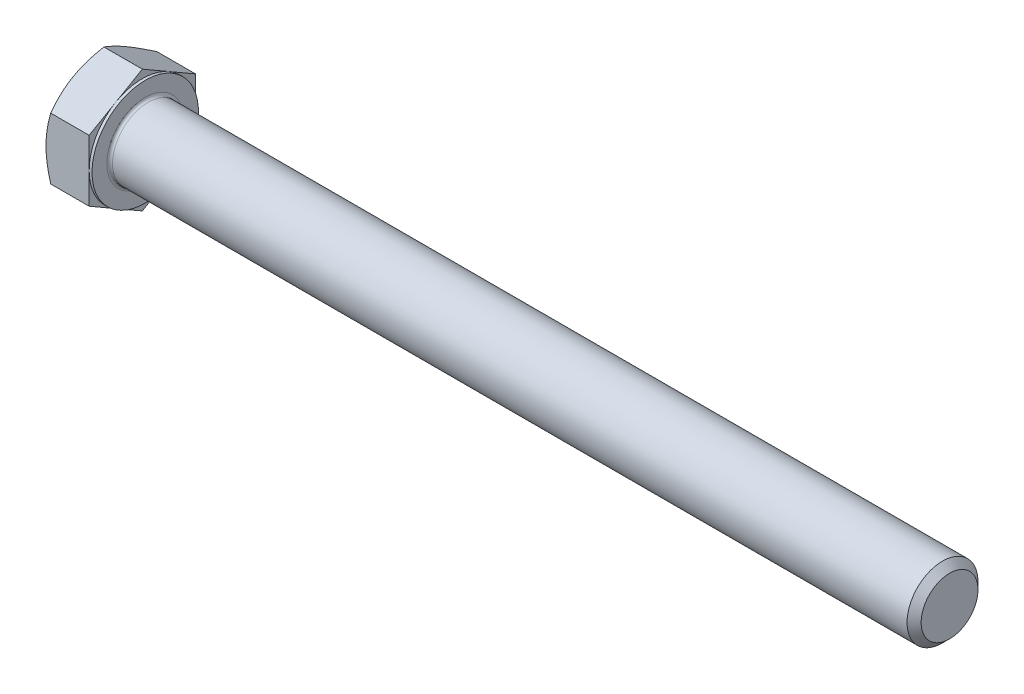
ISO-10303-21;
HEADER;
FILE_DESCRIPTION(('STEP AP214'),'2;1');
FILE_NAME('part.step','',(''),(''),'','','');
FILE_SCHEMA(('AUTOMOTIVE_DESIGN { 1 0 10303 214 1 1 1 1 }'));
ENDSEC;
DATA;
#1=APPLICATION_CONTEXT('core data for automotive mechanical design processes');
#2=APPLICATION_PROTOCOL_DEFINITION('international standard','automotive_design',2000,#1);
#3=PRODUCT_CONTEXT('',#1,'mechanical');
#4=PRODUCT('Part','Part','',(#3));
#5=PRODUCT_RELATED_PRODUCT_CATEGORY('part','',(#4));
#6=PRODUCT_DEFINITION_FORMATION('','',#4);
#7=PRODUCT_DEFINITION_CONTEXT('part definition',#1,'design');
#8=PRODUCT_DEFINITION('design','',#6,#7);
#9=PRODUCT_DEFINITION_SHAPE('','',#8);
#10=(LENGTH_UNIT() NAMED_UNIT(*) SI_UNIT(.MILLI.,.METRE.));
#11=(NAMED_UNIT(*) PLANE_ANGLE_UNIT() SI_UNIT($,.RADIAN.));
#12=(NAMED_UNIT(*) SI_UNIT($,.STERADIAN.) SOLID_ANGLE_UNIT());
#13=UNCERTAINTY_MEASURE_WITH_UNIT(LENGTH_MEASURE(1.E-05),#10,'distance_accuracy_value','');
#14=(GEOMETRIC_REPRESENTATION_CONTEXT(3) GLOBAL_UNCERTAINTY_ASSIGNED_CONTEXT((#13)) GLOBAL_UNIT_ASSIGNED_CONTEXT((#10,
#11,#12)) REPRESENTATION_CONTEXT('',''));
#15=CARTESIAN_POINT('',(0.,0.,0.));
#16=DIRECTION('',(0.,0.,1.));
#17=DIRECTION('',(1.,0.,0.));
#18=AXIS2_PLACEMENT_3D('',#15,#16,#17);
#19=CARTESIAN_POINT('',(0.,8.24155962262808,0.));
#20=DIRECTION('',(1.,0.,0.));
#21=DIRECTION('',(0.,0.,-1.));
#22=AXIS2_PLACEMENT_3D('',#19,#20,#21);
#23=PLANE('',#22);
#24=CARTESIAN_POINT('',(0.,0.,0.));
#25=DIRECTION('',(1.,0.,0.));
#26=DIRECTION('',(0.,0.,-1.));
#27=AXIS2_PLACEMENT_3D('',#24,#25,#26);
#28=CIRCLE('',#27,7.1374);
#29=CARTESIAN_POINT('',(0.,-6.18116971697105,-3.56870000000001));
#30=VERTEX_POINT('',#29);
#31=CARTESIAN_POINT('',(0.,0.,-7.1374));
#32=VERTEX_POINT('',#31);
#33=EDGE_CURVE('E115',#30,#32,#28,.T.);
#34=ORIENTED_EDGE('',*,*,#33,.F.);
#35=CARTESIAN_POINT('',(0.,0.,0.));
#36=DIRECTION('',(1.,0.,0.));
#37=DIRECTION('',(0.,0.,-1.));
#38=AXIS2_PLACEMENT_3D('',#35,#36,#37);
#39=CIRCLE('',#38,7.1374);
#40=CARTESIAN_POINT('',(0.,-6.18116971697106,3.56870000000001));
#41=VERTEX_POINT('',#40);
#42=EDGE_CURVE('E112',#41,#30,#39,.T.);
#43=ORIENTED_EDGE('',*,*,#42,.F.);
#44=CARTESIAN_POINT('',(0.,0.,0.));
#45=DIRECTION('',(1.,0.,0.));
#46=DIRECTION('',(0.,0.,-1.));
#47=AXIS2_PLACEMENT_3D('',#44,#45,#46);
#48=CIRCLE('',#47,7.1374);
#49=CARTESIAN_POINT('',(0.,0.,7.1374));
#50=VERTEX_POINT('',#49);
#51=EDGE_CURVE('E463',#50,#41,#48,.T.);
#52=ORIENTED_EDGE('',*,*,#51,.F.);
#53=CARTESIAN_POINT('',(0.,0.,0.));
#54=DIRECTION('',(1.,0.,0.));
#55=DIRECTION('',(0.,0.,-1.));
#56=AXIS2_PLACEMENT_3D('',#53,#54,#55);
#57=CIRCLE('',#56,7.1374);
#58=CARTESIAN_POINT('',(0.,6.18116971697105,3.56870000000001));
#59=VERTEX_POINT('',#58);
#60=EDGE_CURVE('E173',#59,#50,#57,.T.);
#61=ORIENTED_EDGE('',*,*,#60,.F.);
#62=CARTESIAN_POINT('',(0.,0.,0.));
#63=DIRECTION('',(1.,0.,0.));
#64=DIRECTION('',(0.,0.,-1.));
#65=AXIS2_PLACEMENT_3D('',#62,#63,#64);
#66=CIRCLE('',#65,7.1374);
#67=CARTESIAN_POINT('',(0.,6.18116971697105,-3.56870000000001));
#68=VERTEX_POINT('',#67);
#69=EDGE_CURVE('E461',#68,#59,#66,.T.);
#70=ORIENTED_EDGE('',*,*,#69,.F.);
#71=CARTESIAN_POINT('',(0.,0.,0.));
#72=DIRECTION('',(1.,0.,0.));
#73=DIRECTION('',(0.,0.,-1.));
#74=AXIS2_PLACEMENT_3D('',#71,#72,#73);
#75=CIRCLE('',#74,7.1374);
#76=EDGE_CURVE('E118',#32,#68,#75,.T.);
#77=ORIENTED_EDGE('',*,*,#76,.F.);
#78=EDGE_LOOP('',(#34,#43,#52,#61,#70,#77));
#79=FACE_BOUND('',#78,.T.);
#80=ADVANCED_FACE('F18',(#79),#23,.F.);
#81=CARTESIAN_POINT('',(0.641311776484754,0.,0.));
#82=DIRECTION('',(1.,0.,0.));
#83=DIRECTION('',(0.,0.,-1.));
#84=AXIS2_PLACEMENT_3D('',#81,#82,#83);
#85=CONICAL_SURFACE('',#84,8.24818458036387,1.0471975511966);
#86=ORIENTED_EDGE('',*,*,#42,.T.);
#87=CARTESIAN_POINT('',(0.,-6.18116971697106,-3.56870000000002));
#88=CARTESIAN_POINT('',(-2.91702878281906E-05,-6.26862170985652,-3.41722870509925));
#89=CARTESIAN_POINT('',(0.00371114889844038,-6.35606948988297,-3.26576470708432));
#90=CARTESIAN_POINT('',(0.0185139577467835,-6.53079334497843,-2.9631341127647));
#91=CARTESIAN_POINT('',(0.0295749978503088,-6.61806945060963,-2.81196746352471));
#92=CARTESIAN_POINT('',(0.0587296036169501,-6.7918862225359,-2.5109079833408));
#93=CARTESIAN_POINT('',(0.0767877659737066,-6.87842838481195,-2.3610125612818));
#94=CARTESIAN_POINT('',(0.119548178265526,-7.05110039256495,-2.06193587080869));
#95=CARTESIAN_POINT('',(0.144250603082628,-7.13723022712836,-1.91275462129736));
#96=CARTESIAN_POINT('',(0.227561148311189,-7.39464422393007,-1.46690050025742));
#97=CARTESIAN_POINT('',(0.295412992760169,-7.56518058886256,-1.17152285165624));
#98=CARTESIAN_POINT('',(0.451896700790797,-7.90478678087675,-0.583307672522674));
#99=CARTESIAN_POINT('',(0.540632343376944,-8.07384476218822,-0.290490659466179));
#100=CARTESIAN_POINT('',(0.637486855352638,-8.2415596226281,0.));
#101=B_SPLINE_CURVE_WITH_KNOTS('',3,(#87,#88,#89,#90,#91,#92,#93,#94,#95,#96,#97,#98,#99,#100),
.UNSPECIFIED.,.F.,.F.,(4,2,2,2,2,2,4),(0.,0.524658409500519,1.04921296370403,1.5711473776056,
2.09309553056225,3.13562382142666,4.18344647054619),.UNSPECIFIED.);
#102=CARTESIAN_POINT('',(0.637486855352637,-8.2415596226281,0.));
#103=VERTEX_POINT('',#102);
#104=EDGE_CURVE('E130',#30,#103,#101,.T.);
#105=ORIENTED_EDGE('',*,*,#104,.T.);
#106=CARTESIAN_POINT('',(0.637486855352637,-8.2415596226281,0.));
#107=CARTESIAN_POINT('',(0.540632343376944,-8.07384476218822,0.290490659466181));
#108=CARTESIAN_POINT('',(0.451896700790797,-7.90478678087675,0.583307672522676));
#109=CARTESIAN_POINT('',(0.295412992760169,-7.56518058886257,1.17152285165624));
#110=CARTESIAN_POINT('',(0.227561148311189,-7.39464422393008,1.46690050025742));
#111=CARTESIAN_POINT('',(0.14425060308263,-7.13723022712836,1.91275462129736));
#112=CARTESIAN_POINT('',(0.119548178265528,-7.05110039256495,2.06193587080869));
#113=CARTESIAN_POINT('',(0.0767877659737086,-6.87842838481196,2.3610125612818));
#114=CARTESIAN_POINT('',(0.0587296036169518,-6.7918862225359,2.5109079833408));
#115=CARTESIAN_POINT('',(0.0295749978503104,-6.61806945060963,2.81196746352471));
#116=CARTESIAN_POINT('',(0.0185139577467855,-6.53079334497843,2.9631341127647));
#117=CARTESIAN_POINT('',(0.00371114889844278,-6.35606948988298,3.26576470708432));
#118=CARTESIAN_POINT('',(-2.91702878256121E-05,-6.26862170985652,3.41722870509925));
#119=CARTESIAN_POINT('',(0.,-6.18116971697107,3.56870000000002));
#120=B_SPLINE_CURVE_WITH_KNOTS('',3,(#106,#107,#108,#109,#110,#111,#112,#113,#114,#115,#116,
#117,#118,#119),.UNSPECIFIED.,.F.,.F.,(4,2,2,2,2,2,4),(0.,1.04782264911953,2.09035093998394,
2.61229909294058,3.13423350684215,3.65878806104566,4.18344647054618),.UNSPECIFIED.);
#121=EDGE_CURVE('E136',#103,#41,#120,.T.);
#122=ORIENTED_EDGE('',*,*,#121,.T.);
#123=EDGE_LOOP('',(#86,#105,#122));
#124=FACE_BOUND('',#123,.T.);
#125=ADVANCED_FACE('F134',(#124),#85,.T.);
#126=CARTESIAN_POINT('',(0.641311776484743,0.,0.));
#127=DIRECTION('',(1.,0.,0.));
#128=DIRECTION('',(0.,0.,-1.));
#129=AXIS2_PLACEMENT_3D('',#126,#127,#128);
#130=CONICAL_SURFACE('',#129,8.24818458036385,1.0471975511966);
#131=ORIENTED_EDGE('',*,*,#33,.T.);
#132=CARTESIAN_POINT('',(0.,0.,-7.1374));
#133=CARTESIAN_POINT('',(-2.91702878363875E-05,-0.174903985770917,-7.1374));
#134=CARTESIAN_POINT('',(0.0037111488984321,-0.349799545823828,-7.1374));
#135=CARTESIAN_POINT('',(0.0185139577467752,-0.699247256014727,-7.1374));
#136=CARTESIAN_POINT('',(0.0295749978503004,-0.873799467277128,-7.1374));
#137=CARTESIAN_POINT('',(0.0587296036169417,-1.22143301112966,-7.1374));
#138=CARTESIAN_POINT('',(0.0767877659736981,-1.39451733568178,-7.1374));
#139=CARTESIAN_POINT('',(0.119548178265518,-1.73986135118776,-7.1374));
#140=CARTESIAN_POINT('',(0.144250603082619,-1.91212102031459,-7.1374));
#141=CARTESIAN_POINT('',(0.227561148311179,-2.42694901391801,-7.1374));
#142=CARTESIAN_POINT('',(0.295412992760159,-2.76802174378299,-7.1374));
#143=CARTESIAN_POINT('',(0.451896700790786,-3.44723412781136,-7.1374));
#144=CARTESIAN_POINT('',(0.540632343376933,-3.7853500904343,-7.1374));
#145=CARTESIAN_POINT('',(0.637486855352627,-4.12077981131404,-7.1374));
#146=B_SPLINE_CURVE_WITH_KNOTS('',3,(#132,#133,#134,#135,#136,#137,#138,#139,#140,#141,#142,
#143,#144,#145),.UNSPECIFIED.,.F.,.F.,(4,2,2,2,2,2,4),(0.,0.524658409500517,1.04921296370403,
1.5711473776056,2.09309553056224,3.13562382142665,4.18344647054617),.UNSPECIFIED.);
#147=CARTESIAN_POINT('',(0.637486855352626,-4.12077981131404,-7.1374));
#148=VERTEX_POINT('',#147);
#149=EDGE_CURVE('E126',#32,#148,#146,.T.);
#150=ORIENTED_EDGE('',*,*,#149,.T.);
#151=CARTESIAN_POINT('',(0.637486855352626,-4.12077981131404,-7.1374));
#152=CARTESIAN_POINT('',(0.540632343376933,-4.28849467175391,-6.84690934053382));
#153=CARTESIAN_POINT('',(0.451896700790788,-4.45755265306538,-6.55409232747733));
#154=CARTESIAN_POINT('',(0.295412992760162,-4.79715884507957,-5.96587714834377));
#155=CARTESIAN_POINT('',(0.227561148311183,-4.96769521001206,-5.6704994997426));
#156=CARTESIAN_POINT('',(0.144250603082625,-5.22510920681377,-5.22464537870266));
#157=CARTESIAN_POINT('',(0.119548178265524,-5.31123904137718,-5.07546412919133));
#158=CARTESIAN_POINT('',(0.076787765973705,-5.48391104913017,-4.77638743871822));
#159=CARTESIAN_POINT('',(0.0587296036169484,-5.57045321140623,-4.62649201665922));
#160=CARTESIAN_POINT('',(0.0295749978503076,-5.7442699833325,-4.32543253647532));
#161=CARTESIAN_POINT('',(0.0185139577467831,-5.8315460889637,-4.17426588723533));
#162=CARTESIAN_POINT('',(0.00371114889844091,-6.00626994405915,-3.87163529291571));
#163=CARTESIAN_POINT('',(-2.91702878274496E-05,-6.0937177240856,-3.72017129490078));
#164=CARTESIAN_POINT('',(0.,-6.18116971697106,-3.56870000000002));
#165=B_SPLINE_CURVE_WITH_KNOTS('',3,(#151,#152,#153,#154,#155,#156,#157,#158,#159,#160,#161,
#162,#163,#164),.UNSPECIFIED.,.F.,.F.,(4,2,2,2,2,2,4),(0.,1.04782264911952,2.09035093998392,
2.61229909294056,3.13423350684212,3.65878806104563,4.18344647054614),.UNSPECIFIED.);
#166=EDGE_CURVE('E124',#148,#30,#165,.T.);
#167=ORIENTED_EDGE('',*,*,#166,.T.);
#168=EDGE_LOOP('',(#131,#150,#167));
#169=FACE_BOUND('',#168,.T.);
#170=ADVANCED_FACE('F125',(#169),#130,.T.);
#171=CARTESIAN_POINT('',(0.641311776484739,0.,0.));
#172=DIRECTION('',(1.,0.,0.));
#173=DIRECTION('',(0.,0.,-1.));
#174=AXIS2_PLACEMENT_3D('',#171,#172,#173);
#175=CONICAL_SURFACE('',#174,8.24818458036384,1.0471975511966);
#176=CARTESIAN_POINT('',(0.637486855352624,4.12077981131404,-7.1374));
#177=CARTESIAN_POINT('',(0.540632343376931,3.78535009043429,-7.1374));
#178=CARTESIAN_POINT('',(0.451896700790785,3.44723412781136,-7.1374));
#179=CARTESIAN_POINT('',(0.295412992760157,2.76802174378299,-7.1374));
#180=CARTESIAN_POINT('',(0.227561148311177,2.42694901391801,-7.1374));
#181=CARTESIAN_POINT('',(0.144250603082619,1.91212102031458,-7.1374));
#182=CARTESIAN_POINT('',(0.119548178265517,1.73986135118776,-7.1374));
#183=CARTESIAN_POINT('',(0.076787765973698,1.39451733568178,-7.1374));
#184=CARTESIAN_POINT('',(0.0587296036169412,1.22143301112966,-7.1374));
#185=CARTESIAN_POINT('',(0.0295749978502998,0.873799467277126,-7.1374));
#186=CARTESIAN_POINT('',(0.018513957746775,0.699247256014726,-7.1374));
#187=CARTESIAN_POINT('',(0.0037111488984325,0.349799545823827,-7.1374));
#188=CARTESIAN_POINT('',(-2.91702878357943E-05,0.174903985770916,-7.1374));
#189=CARTESIAN_POINT('',(0.,0.,-7.1374));
#190=B_SPLINE_CURVE_WITH_KNOTS('',3,(#176,#177,#178,#179,#180,#181,#182,#183,#184,#185,#186,
#187,#188,#189),.UNSPECIFIED.,.F.,.F.,(4,2,2,2,2,2,4),(0.,1.04782264911952,2.09035093998393,
2.61229909294057,3.13423350684214,3.65878806104565,4.18344647054616),.UNSPECIFIED.);
#191=CARTESIAN_POINT('',(0.637486855352624,4.12077981131404,-7.1374));
#192=VERTEX_POINT('',#191);
#193=EDGE_CURVE('E144',#192,#32,#190,.T.);
#194=ORIENTED_EDGE('',*,*,#193,.T.);
#195=ORIENTED_EDGE('',*,*,#76,.T.);
#196=CARTESIAN_POINT('',(0.,6.18116971697105,-3.56870000000001));
#197=CARTESIAN_POINT('',(-2.9170287832926E-05,6.0937177240856,-3.72017129490077));
#198=CARTESIAN_POINT('',(0.00371114889843545,6.00626994405914,-3.8716352929157));
#199=CARTESIAN_POINT('',(0.018513957746778,5.83154608896369,-4.17426588723532));
#200=CARTESIAN_POINT('',(0.0295749978503029,5.74426998333249,-4.32543253647531));
#201=CARTESIAN_POINT('',(0.0587296036169437,5.57045321140622,-4.62649201665922));
#202=CARTESIAN_POINT('',(0.0767877659737001,5.48391104913017,-4.77638743871822));
#203=CARTESIAN_POINT('',(0.119548178265519,5.31123904137718,-5.07546412919132));
#204=CARTESIAN_POINT('',(0.144250603082621,5.22510920681376,-5.22464537870265));
#205=CARTESIAN_POINT('',(0.22756114831118,4.96769521001205,-5.67049949974259));
#206=CARTESIAN_POINT('',(0.295412992760159,4.79715884507956,-5.96587714834377));
#207=CARTESIAN_POINT('',(0.451896700790785,4.45755265306538,-6.55409232747733));
#208=CARTESIAN_POINT('',(0.540632343376931,4.28849467175391,-6.84690934053382));
#209=CARTESIAN_POINT('',(0.637486855352624,4.12077981131404,-7.1374));
#210=B_SPLINE_CURVE_WITH_KNOTS('',3,(#196,#197,#198,#199,#200,#201,#202,#203,#204,#205,#206,
#207,#208,#209),.UNSPECIFIED.,.F.,.F.,(4,2,2,2,2,2,4),(0.,0.524658409500515,1.04921296370402,
1.57114737760559,2.09309553056223,3.13562382142663,4.18344647054615),.UNSPECIFIED.);
#211=EDGE_CURVE('E250',#68,#192,#210,.T.);
#212=ORIENTED_EDGE('',*,*,#211,.T.);
#213=EDGE_LOOP('',(#194,#195,#212));
#214=FACE_BOUND('',#213,.T.);
#215=ADVANCED_FACE('F240',(#214),#175,.T.);
#216=CARTESIAN_POINT('',(0.641311776484745,0.,0.));
#217=DIRECTION('',(1.,0.,0.));
#218=DIRECTION('',(0.,0.,-1.));
#219=AXIS2_PLACEMENT_3D('',#216,#217,#218);
#220=CONICAL_SURFACE('',#219,8.24818458036385,1.0471975511966);
#221=CARTESIAN_POINT('',(0.637486855352629,8.24155962262808,0.));
#222=CARTESIAN_POINT('',(0.540632343376936,8.07384476218821,-0.290490659466181));
#223=CARTESIAN_POINT('',(0.45189670079079,7.90478678087674,-0.583307672522675));
#224=CARTESIAN_POINT('',(0.295412992760162,7.56518058886255,-1.17152285165624));
#225=CARTESIAN_POINT('',(0.227561148311182,7.39464422393006,-1.46690050025742));
#226=CARTESIAN_POINT('',(0.144250603082622,7.13723022712835,-1.91275462129736));
#227=CARTESIAN_POINT('',(0.119548178265521,7.05110039256494,-2.06193587080869));
#228=CARTESIAN_POINT('',(0.076787765973701,6.87842838481194,-2.3610125612818));
#229=CARTESIAN_POINT('',(0.0587296036169442,6.79188622253589,-2.5109079833408));
#230=CARTESIAN_POINT('',(0.0295749978503029,6.61806945060962,-2.81196746352471));
#231=CARTESIAN_POINT('',(0.018513957746778,6.53079334497842,-2.96313411276469));
#232=CARTESIAN_POINT('',(0.00371114889843529,6.35606948988297,-3.26576470708432));
#233=CARTESIAN_POINT('',(-2.91702878331806E-05,6.26862170985651,-3.41722870509924));
#234=CARTESIAN_POINT('',(0.,6.18116971697105,-3.56870000000001));
#235=B_SPLINE_CURVE_WITH_KNOTS('',3,(#221,#222,#223,#224,#225,#226,#227,#228,#229,#230,#231,
#232,#233,#234),.UNSPECIFIED.,.F.,.F.,(4,2,2,2,2,2,4),(0.,1.04782264911952,2.09035093998393,
2.61229909294058,3.13423350684215,3.65878806104566,4.18344647054617),.UNSPECIFIED.);
#236=CARTESIAN_POINT('',(0.637486855352629,8.24155962262808,0.));
#237=VERTEX_POINT('',#236);
#238=EDGE_CURVE('E245',#237,#68,#235,.T.);
#239=ORIENTED_EDGE('',*,*,#238,.T.);
#240=ORIENTED_EDGE('',*,*,#69,.T.);
#241=CARTESIAN_POINT('',(0.,6.18116971697105,3.56870000000001));
#242=CARTESIAN_POINT('',(-2.9170287834756E-05,6.26862170985651,3.41722870509925));
#243=CARTESIAN_POINT('',(0.00371114889843365,6.35606948988296,3.26576470708432));
#244=CARTESIAN_POINT('',(0.018513957746776,6.53079334497841,2.9631341127647));
#245=CARTESIAN_POINT('',(0.0295749978503007,6.61806945060961,2.81196746352471));
#246=CARTESIAN_POINT('',(0.0587296036169419,6.79188622253588,2.5109079833408));
#247=CARTESIAN_POINT('',(0.0767877659736988,6.87842838481194,2.3610125612818));
#248=CARTESIAN_POINT('',(0.119548178265519,7.05110039256493,2.06193587080869));
#249=CARTESIAN_POINT('',(0.14425060308262,7.13723022712835,1.91275462129736));
#250=CARTESIAN_POINT('',(0.22756114831118,7.39464422393006,1.46690050025742));
#251=CARTESIAN_POINT('',(0.295412992760161,7.56518058886255,1.17152285165624));
#252=CARTESIAN_POINT('',(0.451896700790789,7.90478678087674,0.583307672522675));
#253=CARTESIAN_POINT('',(0.540632343376935,8.07384476218821,0.29049065946618));
#254=CARTESIAN_POINT('',(0.637486855352629,8.24155962262808,0.));
#255=B_SPLINE_CURVE_WITH_KNOTS('',3,(#241,#242,#243,#244,#245,#246,#247,#248,#249,#250,#251,
#252,#253,#254),.UNSPECIFIED.,.F.,.F.,(4,2,2,2,2,2,4),(0.,0.524658409500518,1.04921296370403,
1.5711473776056,2.09309553056224,3.13562382142665,4.18344647054618),.UNSPECIFIED.);
#256=EDGE_CURVE('E232',#59,#237,#255,.T.);
#257=ORIENTED_EDGE('',*,*,#256,.T.);
#258=EDGE_LOOP('',(#239,#240,#257));
#259=FACE_BOUND('',#258,.T.);
#260=ADVANCED_FACE('F237',(#259),#220,.T.);
#261=CARTESIAN_POINT('',(0.641311776484745,0.,0.));
#262=DIRECTION('',(1.,0.,0.));
#263=DIRECTION('',(0.,0.,-1.));
#264=AXIS2_PLACEMENT_3D('',#261,#262,#263);
#265=CONICAL_SURFACE('',#264,8.24818458036385,1.0471975511966);
#266=ORIENTED_EDGE('',*,*,#51,.T.);
#267=CARTESIAN_POINT('',(0.,-6.18116971697107,3.56870000000002));
#268=CARTESIAN_POINT('',(-2.9170287825595E-05,-6.09371772408561,3.72017129490078));
#269=CARTESIAN_POINT('',(0.00371114889844298,-6.00626994405915,3.87163529291571));
#270=CARTESIAN_POINT('',(0.0185139577467859,-5.8315460889637,4.17426588723533));
#271=CARTESIAN_POINT('',(0.0295749978503109,-5.7442699833325,4.32543253647531));
#272=CARTESIAN_POINT('',(0.0587296036169516,-5.57045321140624,4.62649201665922));
#273=CARTESIAN_POINT('',(0.0767877659737078,-5.48391104913018,4.77638743871822));
#274=CARTESIAN_POINT('',(0.119548178265527,-5.31123904137719,5.07546412919133));
#275=CARTESIAN_POINT('',(0.144250603082628,-5.22510920681378,5.22464537870266));
#276=CARTESIAN_POINT('',(0.227561148311187,-4.96769521001206,5.6704994997426));
#277=CARTESIAN_POINT('',(0.295412992760166,-4.79715884507958,5.96587714834377));
#278=CARTESIAN_POINT('',(0.451896700790791,-4.45755265306539,6.55409232747733));
#279=CARTESIAN_POINT('',(0.540632343376936,-4.28849467175392,6.84690934053382));
#280=CARTESIAN_POINT('',(0.637486855352629,-4.12077981131405,7.1374));
#281=B_SPLINE_CURVE_WITH_KNOTS('',3,(#267,#268,#269,#270,#271,#272,#273,#274,#275,#276,#277,
#278,#279,#280),.UNSPECIFIED.,.F.,.F.,(4,2,2,2,2,2,4),(0.,0.524658409500513,1.04921296370402,
1.57114737760559,2.09309553056223,3.13562382142663,4.18344647054615),.UNSPECIFIED.);
#282=CARTESIAN_POINT('',(0.637486855352629,-4.12077981131405,7.1374));
#283=VERTEX_POINT('',#282);
#284=EDGE_CURVE('E131',#41,#283,#281,.T.);
#285=ORIENTED_EDGE('',*,*,#284,.T.);
#286=CARTESIAN_POINT('',(0.637486855352629,-4.12077981131405,7.1374));
#287=CARTESIAN_POINT('',(0.540632343376935,-3.78535009043431,7.1374));
#288=CARTESIAN_POINT('',(0.451896700790788,-3.44723412781137,7.1374));
#289=CARTESIAN_POINT('',(0.29541299276016,-2.768021743783,7.1374));
#290=CARTESIAN_POINT('',(0.22756114831118,-2.42694901391802,7.1374));
#291=CARTESIAN_POINT('',(0.14425060308262,-1.91212102031459,7.1374));
#292=CARTESIAN_POINT('',(0.119548178265519,-1.73986135118776,7.1374));
#293=CARTESIAN_POINT('',(0.0767877659736989,-1.39451733568178,7.1374));
#294=CARTESIAN_POINT('',(0.0587296036169421,-1.22143301112967,7.1374));
#295=CARTESIAN_POINT('',(0.0295749978503008,-0.87379946727713,7.1374));
#296=CARTESIAN_POINT('',(0.018513957746776,-0.699247256014728,7.1374));
#297=CARTESIAN_POINT('',(0.00371114889843334,-0.349799545823828,7.1374));
#298=CARTESIAN_POINT('',(-2.91702878350887E-05,-0.174903985770916,7.1374));
#299=CARTESIAN_POINT('',(0.,0.,7.1374));
#300=B_SPLINE_CURVE_WITH_KNOTS('',3,(#286,#287,#288,#289,#290,#291,#292,#293,#294,#295,#296,
#297,#298,#299),.UNSPECIFIED.,.F.,.F.,(4,2,2,2,2,2,4),(0.,1.04782264911953,2.09035093998394,
2.61229909294058,3.13423350684215,3.65878806104566,4.18344647054618),.UNSPECIFIED.);
#301=EDGE_CURVE('E210',#283,#50,#300,.T.);
#302=ORIENTED_EDGE('',*,*,#301,.T.);
#303=EDGE_LOOP('',(#266,#285,#302));
#304=FACE_BOUND('',#303,.T.);
#305=ADVANCED_FACE('F188',(#304),#265,.T.);
#306=CARTESIAN_POINT('',(0.641311776484738,0.,0.));
#307=DIRECTION('',(1.,0.,0.));
#308=DIRECTION('',(0.,0.,-1.));
#309=AXIS2_PLACEMENT_3D('',#306,#307,#308);
#310=CONICAL_SURFACE('',#309,8.24818458036384,1.0471975511966);
#311=CARTESIAN_POINT('',(0.637486855352622,4.12077981131403,7.1374));
#312=CARTESIAN_POINT('',(0.540632343376929,4.2884946717539,6.84690934053382));
#313=CARTESIAN_POINT('',(0.451896700790783,4.45755265306537,6.55409232747733));
#314=CARTESIAN_POINT('',(0.295412992760157,4.79715884507955,5.96587714834377));
#315=CARTESIAN_POINT('',(0.227561148311178,4.96769521001204,5.67049949974259));
#316=CARTESIAN_POINT('',(0.144250603082619,5.22510920681376,5.22464537870266));
#317=CARTESIAN_POINT('',(0.119548178265518,5.31123904137717,5.07546412919132));
#318=CARTESIAN_POINT('',(0.0767877659736985,5.48391104913016,4.77638743871822));
#319=CARTESIAN_POINT('',(0.0587296036169418,5.57045321140622,4.62649201665922));
#320=CARTESIAN_POINT('',(0.0295749978503007,5.74426998333248,4.32543253647531));
#321=CARTESIAN_POINT('',(0.0185139577467759,5.83154608896368,4.17426588723532));
#322=CARTESIAN_POINT('',(0.00371114889843337,6.00626994405913,3.8716352929157));
#323=CARTESIAN_POINT('',(-2.91702878350612E-05,6.09371772408559,3.72017129490078));
#324=CARTESIAN_POINT('',(0.,6.18116971697105,3.56870000000001));
#325=B_SPLINE_CURVE_WITH_KNOTS('',3,(#311,#312,#313,#314,#315,#316,#317,#318,#319,#320,#321,
#322,#323,#324),.UNSPECIFIED.,.F.,.F.,(4,2,2,2,2,2,4),(0.,1.04782264911952,2.09035093998392,
2.61229909294056,3.13423350684213,3.65878806104564,4.18344647054615),.UNSPECIFIED.);
#326=CARTESIAN_POINT('',(0.637486855352622,4.12077981131403,7.1374));
#327=VERTEX_POINT('',#326);
#328=EDGE_CURVE('E194',#327,#59,#325,.T.);
#329=ORIENTED_EDGE('',*,*,#328,.T.);
#330=ORIENTED_EDGE('',*,*,#60,.T.);
#331=CARTESIAN_POINT('',(0.,0.,7.1374));
#332=CARTESIAN_POINT('',(-2.91702878350349E-05,0.174903985770917,7.1374));
#333=CARTESIAN_POINT('',(0.00371114889843339,0.349799545823827,7.1374));
#334=CARTESIAN_POINT('',(0.0185139577467758,0.699247256014725,7.1374));
#335=CARTESIAN_POINT('',(0.0295749978503005,0.873799467277125,7.1374));
#336=CARTESIAN_POINT('',(0.0587296036169414,1.22143301112966,7.1374));
#337=CARTESIAN_POINT('',(0.076787765973698,1.39451733568177,7.1374));
#338=CARTESIAN_POINT('',(0.119548178265517,1.73986135118775,7.1374));
#339=CARTESIAN_POINT('',(0.144250603082619,1.91212102031458,7.1374));
#340=CARTESIAN_POINT('',(0.227561148311177,2.426949013918,7.1374));
#341=CARTESIAN_POINT('',(0.295412992760157,2.76802174378298,7.1374));
#342=CARTESIAN_POINT('',(0.451896700790783,3.44723412781135,7.1374));
#343=CARTESIAN_POINT('',(0.540632343376929,3.78535009043429,7.1374));
#344=CARTESIAN_POINT('',(0.637486855352622,4.12077981131403,7.1374));
#345=B_SPLINE_CURVE_WITH_KNOTS('',3,(#331,#332,#333,#334,#335,#336,#337,#338,#339,#340,#341,
#342,#343,#344),.UNSPECIFIED.,.F.,.F.,(4,2,2,2,2,2,4),(0.,0.524658409500515,1.04921296370402,
1.57114737760559,2.09309553056223,3.13562382142663,4.18344647054615),.UNSPECIFIED.);
#346=EDGE_CURVE('E202',#50,#327,#345,.T.);
#347=ORIENTED_EDGE('',*,*,#346,.T.);
#348=EDGE_LOOP('',(#329,#330,#347));
#349=FACE_BOUND('',#348,.T.);
#350=ADVANCED_FACE('F183',(#349),#310,.T.);
#351=CARTESIAN_POINT('',(6.1722,-8.2415596226281,0.));
#352=DIRECTION('',(0.,0.866025403784438,-0.500000000000001));
#353=DIRECTION('',(0.,0.500000000000001,0.866025403784438));
#354=AXIS2_PLACEMENT_3D('',#351,#352,#353);
#355=PLANE('',#354);
#356=DIRECTION('',(-1.,0.,0.));
#357=VECTOR('',#356,1.);
#358=CARTESIAN_POINT('',(6.1722,-4.12077981131405,7.1374));
#359=LINE('',#358,#357);
#360=CARTESIAN_POINT('',(5.7912,-4.12077981131405,7.1374));
#361=VERTEX_POINT('',#360);
#362=EDGE_CURVE('E387',#361,#283,#359,.T.);
#363=ORIENTED_EDGE('',*,*,#362,.T.);
#364=ORIENTED_EDGE('',*,*,#284,.F.);
#365=ORIENTED_EDGE('',*,*,#121,.F.);
#366=DIRECTION('',(1.,0.,0.));
#367=VECTOR('',#366,1.);
#368=CARTESIAN_POINT('',(6.1722,-8.2415596226281,0.));
#369=LINE('',#368,#367);
#370=CARTESIAN_POINT('',(5.7912,-8.2415596226281,0.));
#371=VERTEX_POINT('',#370);
#372=EDGE_CURVE('E142',#103,#371,#369,.T.);
#373=ORIENTED_EDGE('',*,*,#372,.T.);
#374=DIRECTION('',(0.,-0.500000000000005,-0.866025403784436));
#375=VECTOR('',#374,1.);
#376=CARTESIAN_POINT('',(5.7912,-6.18116971697105,3.5687));
#377=LINE('',#376,#375);
#378=CARTESIAN_POINT('',(5.7912,-6.18116971697105,3.5687));
#379=VERTEX_POINT('',#378);
#380=EDGE_CURVE('E367',#379,#371,#377,.T.);
#381=ORIENTED_EDGE('',*,*,#380,.F.);
#382=DIRECTION('',(0.,-0.499999999999996,-0.866025403784441));
#383=VECTOR('',#382,1.);
#384=CARTESIAN_POINT('',(5.7912,-4.12077981131405,7.1374));
#385=LINE('',#384,#383);
#386=EDGE_CURVE('E372',#361,#379,#385,.T.);
#387=ORIENTED_EDGE('',*,*,#386,.F.);
#388=EDGE_LOOP('',(#363,#364,#365,#373,#381,#387));
#389=FACE_BOUND('',#388,.T.);
#390=ADVANCED_FACE('F179',(#389),#355,.F.);
#391=CARTESIAN_POINT('',(6.1722,-4.12077981131404,-7.1374));
#392=DIRECTION('',(0.,0.866025403784438,0.500000000000001));
#393=DIRECTION('',(0.,-0.500000000000001,0.866025403784438));
#394=AXIS2_PLACEMENT_3D('',#391,#392,#393);
#395=PLANE('',#394);
#396=ORIENTED_EDGE('',*,*,#372,.F.);
#397=ORIENTED_EDGE('',*,*,#104,.F.);
#398=ORIENTED_EDGE('',*,*,#166,.F.);
#399=DIRECTION('',(1.,0.,0.));
#400=VECTOR('',#399,1.);
#401=CARTESIAN_POINT('',(6.1722,-4.12077981131404,-7.1374));
#402=LINE('',#401,#400);
#403=CARTESIAN_POINT('',(5.7912,-4.12077981131404,-7.1374));
#404=VERTEX_POINT('',#403);
#405=EDGE_CURVE('E251',#148,#404,#402,.T.);
#406=ORIENTED_EDGE('',*,*,#405,.T.);
#407=DIRECTION('',(0.,0.499999999999998,-0.866025403784439));
#408=VECTOR('',#407,1.);
#409=CARTESIAN_POINT('',(5.7912,-6.18116971697105,-3.56870000000001));
#410=LINE('',#409,#408);
#411=CARTESIAN_POINT('',(5.7912,-6.18116971697104,-3.56870000000001));
#412=VERTEX_POINT('',#411);
#413=EDGE_CURVE('E357',#412,#404,#410,.T.);
#414=ORIENTED_EDGE('',*,*,#413,.F.);
#415=DIRECTION('',(0.,0.500000000000005,-0.866025403784436));
#416=VECTOR('',#415,1.);
#417=CARTESIAN_POINT('',(5.7912,-8.2415596226281,0.));
#418=LINE('',#417,#416);
#419=EDGE_CURVE('E362',#371,#412,#418,.T.);
#420=ORIENTED_EDGE('',*,*,#419,.F.);
#421=EDGE_LOOP('',(#396,#397,#398,#406,#414,#420));
#422=FACE_BOUND('',#421,.T.);
#423=ADVANCED_FACE('F140',(#422),#395,.F.);
#424=CARTESIAN_POINT('',(6.1722,4.12077981131404,-7.1374));
#425=DIRECTION('',(0.,0.,1.));
#426=DIRECTION('',(0.,-1.,0.));
#427=AXIS2_PLACEMENT_3D('',#424,#425,#426);
#428=PLANE('',#427);
#429=ORIENTED_EDGE('',*,*,#405,.F.);
#430=ORIENTED_EDGE('',*,*,#149,.F.);
#431=ORIENTED_EDGE('',*,*,#193,.F.);
#432=DIRECTION('',(1.,0.,0.));
#433=VECTOR('',#432,1.);
#434=CARTESIAN_POINT('',(6.1722,4.12077981131404,-7.1374));
#435=LINE('',#434,#433);
#436=CARTESIAN_POINT('',(5.7912,4.12077981131404,-7.1374));
#437=VERTEX_POINT('',#436);
#438=EDGE_CURVE('E395',#192,#437,#435,.T.);
#439=ORIENTED_EDGE('',*,*,#438,.T.);
#440=DIRECTION('',(0.,1.,0.));
#441=VECTOR('',#440,1.);
#442=CARTESIAN_POINT('',(5.7912,7.1374,-7.1374));
#443=LINE('',#442,#441);
#444=CARTESIAN_POINT('',(5.7912,0.,-7.1374));
#445=VERTEX_POINT('',#444);
#446=EDGE_CURVE('E342',#445,#437,#443,.T.);
#447=ORIENTED_EDGE('',*,*,#446,.F.);
#448=DIRECTION('',(0.,1.,0.));
#449=VECTOR('',#448,1.);
#450=CARTESIAN_POINT('',(5.7912,7.1374,-7.1374));
#451=LINE('',#450,#449);
#452=EDGE_CURVE('E352',#404,#445,#451,.T.);
#453=ORIENTED_EDGE('',*,*,#452,.F.);
#454=EDGE_LOOP('',(#429,#430,#431,#439,#447,#453));
#455=FACE_BOUND('',#454,.T.);
#456=ADVANCED_FACE('F258',(#455),#428,.F.);
#457=CARTESIAN_POINT('',(6.1722,4.12077981131404,-7.1374));
#458=DIRECTION('',(0.,-0.866025403784438,0.500000000000001));
#459=DIRECTION('',(0.,-0.500000000000001,-0.866025403784438));
#460=AXIS2_PLACEMENT_3D('',#457,#458,#459);
#461=PLANE('',#460);
#462=ORIENTED_EDGE('',*,*,#438,.F.);
#463=ORIENTED_EDGE('',*,*,#211,.F.);
#464=ORIENTED_EDGE('',*,*,#238,.F.);
#465=DIRECTION('',(1.,0.,0.));
#466=VECTOR('',#465,1.);
#467=CARTESIAN_POINT('',(6.1722,8.24155962262808,0.));
#468=LINE('',#467,#466);
#469=CARTESIAN_POINT('',(5.7912,8.24155962262808,0.));
#470=VERTEX_POINT('',#469);
#471=EDGE_CURVE('E236',#237,#470,#468,.T.);
#472=ORIENTED_EDGE('',*,*,#471,.T.);
#473=DIRECTION('',(0.,0.500000000000002,0.866025403784437));
#474=VECTOR('',#473,1.);
#475=CARTESIAN_POINT('',(5.7912,6.18116971697105,-3.56870000000001));
#476=LINE('',#475,#474);
#477=CARTESIAN_POINT('',(5.7912,6.18116971697105,-3.5687));
#478=VERTEX_POINT('',#477);
#479=EDGE_CURVE('E337',#478,#470,#476,.T.);
#480=ORIENTED_EDGE('',*,*,#479,.F.);
#481=DIRECTION('',(0.,0.5,0.866025403784439));
#482=VECTOR('',#481,1.);
#483=CARTESIAN_POINT('',(5.7912,4.12077981131404,-7.1374));
#484=LINE('',#483,#482);
#485=EDGE_CURVE('E347',#437,#478,#484,.T.);
#486=ORIENTED_EDGE('',*,*,#485,.F.);
#487=EDGE_LOOP('',(#462,#463,#464,#472,#480,#486));
#488=FACE_BOUND('',#487,.T.);
#489=ADVANCED_FACE('F228',(#488),#461,.F.);
#490=CARTESIAN_POINT('',(6.1722,8.24155962262808,0.));
#491=DIRECTION('',(0.,-0.866025403784438,-0.500000000000001));
#492=DIRECTION('',(0.,0.500000000000001,-0.866025403784438));
#493=AXIS2_PLACEMENT_3D('',#490,#491,#492);
#494=PLANE('',#493);
#495=ORIENTED_EDGE('',*,*,#471,.F.);
#496=ORIENTED_EDGE('',*,*,#256,.F.);
#497=ORIENTED_EDGE('',*,*,#328,.F.);
#498=DIRECTION('',(-1.,0.,0.));
#499=VECTOR('',#498,1.);
#500=CARTESIAN_POINT('',(6.1722,4.12077981131403,7.1374));
#501=LINE('',#500,#499);
#502=CARTESIAN_POINT('',(5.7912,4.12077981131403,7.1374));
#503=VERTEX_POINT('',#502);
#504=EDGE_CURVE('E209',#327,#503,#501,.F.);
#505=ORIENTED_EDGE('',*,*,#504,.T.);
#506=DIRECTION('',(0.,-0.500000000000001,0.866025403784438));
#507=VECTOR('',#506,1.);
#508=CARTESIAN_POINT('',(5.7912,6.18116971697105,3.56870000000001));
#509=LINE('',#508,#507);
#510=CARTESIAN_POINT('',(5.7912,6.18116971697104,3.56870000000001));
#511=VERTEX_POINT('',#510);
#512=EDGE_CURVE('E327',#511,#503,#509,.T.);
#513=ORIENTED_EDGE('',*,*,#512,.F.);
#514=DIRECTION('',(0.,-0.500000000000002,0.866025403784438));
#515=VECTOR('',#514,1.);
#516=CARTESIAN_POINT('',(5.7912,8.24155962262808,0.));
#517=LINE('',#516,#515);
#518=EDGE_CURVE('E332',#470,#511,#517,.T.);
#519=ORIENTED_EDGE('',*,*,#518,.F.);
#520=EDGE_LOOP('',(#495,#496,#497,#505,#513,#519));
#521=FACE_BOUND('',#520,.T.);
#522=ADVANCED_FACE('F221',(#521),#494,.F.);
#523=CARTESIAN_POINT('',(6.1722,4.12077981131403,7.1374));
#524=DIRECTION('',(0.,0.,-1.));
#525=DIRECTION('',(-1.,0.,0.));
#526=AXIS2_PLACEMENT_3D('',#523,#524,#525);
#527=PLANE('',#526);
#528=ORIENTED_EDGE('',*,*,#504,.F.);
#529=ORIENTED_EDGE('',*,*,#346,.F.);
#530=ORIENTED_EDGE('',*,*,#301,.F.);
#531=ORIENTED_EDGE('',*,*,#362,.F.);
#532=DIRECTION('',(0.,1.,0.));
#533=VECTOR('',#532,1.);
#534=CARTESIAN_POINT('',(5.7912,7.1374,7.1374));
#535=LINE('',#534,#533);
#536=CARTESIAN_POINT('',(5.7912,0.,7.1374));
#537=VERTEX_POINT('',#536);
#538=EDGE_CURVE('E377',#537,#361,#535,.F.);
#539=ORIENTED_EDGE('',*,*,#538,.F.);
#540=DIRECTION('',(0.,1.,0.));
#541=VECTOR('',#540,1.);
#542=CARTESIAN_POINT('',(5.7912,7.1374,7.1374));
#543=LINE('',#542,#541);
#544=EDGE_CURVE('E319',#503,#537,#543,.F.);
#545=ORIENTED_EDGE('',*,*,#544,.F.);
#546=EDGE_LOOP('',(#528,#529,#530,#531,#539,#545));
#547=FACE_BOUND('',#546,.T.);
#548=ADVANCED_FACE('F216',(#547),#527,.F.);
#549=CARTESIAN_POINT('',(5.7912,7.1374,0.));
#550=DIRECTION('',(1.,0.,0.));
#551=DIRECTION('',(0.,0.,-1.));
#552=AXIS2_PLACEMENT_3D('',#549,#550,#551);
#553=PLANE('',#552);
#554=ORIENTED_EDGE('',*,*,#386,.T.);
#555=CARTESIAN_POINT('',(5.7912,0.,0.));
#556=DIRECTION('',(-1.,0.,0.));
#557=DIRECTION('',(0.,0.,1.));
#558=AXIS2_PLACEMENT_3D('',#555,#556,#557);
#559=CIRCLE('',#558,7.1374);
#560=EDGE_CURVE('E211',#537,#379,#559,.F.);
#561=ORIENTED_EDGE('',*,*,#560,.F.);
#562=ORIENTED_EDGE('',*,*,#538,.T.);
#563=EDGE_LOOP('',(#554,#561,#562));
#564=FACE_BOUND('',#563,.T.);
#565=ADVANCED_FACE('F220',(#564),#553,.T.);
#566=CARTESIAN_POINT('',(5.7912,7.1374,0.));
#567=DIRECTION('',(1.,0.,0.));
#568=DIRECTION('',(0.,0.,-1.));
#569=AXIS2_PLACEMENT_3D('',#566,#567,#568);
#570=PLANE('',#569);
#571=ORIENTED_EDGE('',*,*,#419,.T.);
#572=CARTESIAN_POINT('',(5.7912,0.,0.));
#573=DIRECTION('',(-1.,0.,0.));
#574=DIRECTION('',(0.,0.,1.));
#575=AXIS2_PLACEMENT_3D('',#572,#573,#574);
#576=CIRCLE('',#575,7.1374);
#577=EDGE_CURVE('E421',#379,#412,#576,.F.);
#578=ORIENTED_EDGE('',*,*,#577,.F.);
#579=ORIENTED_EDGE('',*,*,#380,.T.);
#580=EDGE_LOOP('',(#571,#578,#579));
#581=FACE_BOUND('',#580,.T.);
#582=ADVANCED_FACE('F441',(#581),#570,.T.);
#583=CARTESIAN_POINT('',(5.7912,7.1374,0.));
#584=DIRECTION('',(1.,0.,0.));
#585=DIRECTION('',(0.,0.,-1.));
#586=AXIS2_PLACEMENT_3D('',#583,#584,#585);
#587=PLANE('',#586);
#588=ORIENTED_EDGE('',*,*,#452,.T.);
#589=CARTESIAN_POINT('',(5.7912,0.,0.));
#590=DIRECTION('',(-1.,0.,0.));
#591=DIRECTION('',(0.,0.,1.));
#592=AXIS2_PLACEMENT_3D('',#589,#590,#591);
#593=CIRCLE('',#592,7.1374);
#594=EDGE_CURVE('E419',#412,#445,#593,.F.);
#595=ORIENTED_EDGE('',*,*,#594,.F.);
#596=ORIENTED_EDGE('',*,*,#413,.T.);
#597=EDGE_LOOP('',(#588,#595,#596));
#598=FACE_BOUND('',#597,.T.);
#599=ADVANCED_FACE('F444',(#598),#587,.T.);
#600=CARTESIAN_POINT('',(5.7912,7.1374,0.));
#601=DIRECTION('',(1.,0.,0.));
#602=DIRECTION('',(0.,0.,-1.));
#603=AXIS2_PLACEMENT_3D('',#600,#601,#602);
#604=PLANE('',#603);
#605=CARTESIAN_POINT('',(5.7912,0.,0.));
#606=DIRECTION('',(-1.,0.,0.));
#607=DIRECTION('',(0.,0.,1.));
#608=AXIS2_PLACEMENT_3D('',#605,#606,#607);
#609=CIRCLE('',#608,7.1374);
#610=EDGE_CURVE('E416',#445,#478,#609,.F.);
#611=ORIENTED_EDGE('',*,*,#610,.F.);
#612=ORIENTED_EDGE('',*,*,#446,.T.);
#613=ORIENTED_EDGE('',*,*,#485,.T.);
#614=EDGE_LOOP('',(#611,#612,#613));
#615=FACE_BOUND('',#614,.T.);
#616=ADVANCED_FACE('F448',(#615),#604,.T.);
#617=CARTESIAN_POINT('',(5.7912,7.1374,0.));
#618=DIRECTION('',(1.,0.,0.));
#619=DIRECTION('',(0.,0.,-1.));
#620=AXIS2_PLACEMENT_3D('',#617,#618,#619);
#621=PLANE('',#620);
#622=ORIENTED_EDGE('',*,*,#518,.T.);
#623=CARTESIAN_POINT('',(5.7912,0.,0.));
#624=DIRECTION('',(-1.,0.,0.));
#625=DIRECTION('',(0.,0.,1.));
#626=AXIS2_PLACEMENT_3D('',#623,#624,#625);
#627=CIRCLE('',#626,7.1374);
#628=EDGE_CURVE('E413',#478,#511,#627,.F.);
#629=ORIENTED_EDGE('',*,*,#628,.F.);
#630=ORIENTED_EDGE('',*,*,#479,.T.);
#631=EDGE_LOOP('',(#622,#629,#630));
#632=FACE_BOUND('',#631,.T.);
#633=ADVANCED_FACE('F453',(#632),#621,.T.);
#634=CARTESIAN_POINT('',(5.7912,7.1374,0.));
#635=DIRECTION('',(1.,0.,0.));
#636=DIRECTION('',(0.,0.,-1.));
#637=AXIS2_PLACEMENT_3D('',#634,#635,#636);
#638=PLANE('',#637);
#639=ORIENTED_EDGE('',*,*,#544,.T.);
#640=CARTESIAN_POINT('',(5.7912,0.,0.));
#641=DIRECTION('',(-1.,0.,0.));
#642=DIRECTION('',(0.,0.,1.));
#643=AXIS2_PLACEMENT_3D('',#640,#641,#642);
#644=CIRCLE('',#643,7.1374);
#645=EDGE_CURVE('E410',#511,#537,#644,.F.);
#646=ORIENTED_EDGE('',*,*,#645,.F.);
#647=ORIENTED_EDGE('',*,*,#512,.T.);
#648=EDGE_LOOP('',(#639,#646,#647));
#649=FACE_BOUND('',#648,.T.);
#650=ADVANCED_FACE('F434',(#649),#638,.T.);
#651=CARTESIAN_POINT('',(0.,0.,0.));
#652=DIRECTION('',(-1.,0.,0.));
#653=DIRECTION('',(0.,0.,1.));
#654=AXIS2_PLACEMENT_3D('',#651,#652,#653);
#655=CYLINDRICAL_SURFACE('',#654,7.1374);
#656=ORIENTED_EDGE('',*,*,#594,.T.);
#657=ORIENTED_EDGE('',*,*,#610,.T.);
#658=ORIENTED_EDGE('',*,*,#628,.T.);
#659=ORIENTED_EDGE('',*,*,#645,.T.);
#660=ORIENTED_EDGE('',*,*,#560,.T.);
#661=ORIENTED_EDGE('',*,*,#577,.T.);
#662=EDGE_LOOP('',(#656,#657,#658,#659,#660,#661));
#663=FACE_BOUND('',#662,.T.);
#664=CARTESIAN_POINT('',(6.1722,0.,0.));
#665=DIRECTION('',(-1.,0.,0.));
#666=DIRECTION('',(0.,0.,1.));
#667=AXIS2_PLACEMENT_3D('',#664,#665,#666);
#668=CIRCLE('',#667,7.1374);
#669=CARTESIAN_POINT('',(6.1722,0.,7.1374));
#670=VERTEX_POINT('',#669);
#671=EDGE_CURVE('E407',#670,#670,#668,.F.);
#672=ORIENTED_EDGE('',*,*,#671,.F.);
#673=EDGE_LOOP('',(#672));
#674=FACE_BOUND('',#673,.T.);
#675=ADVANCED_FACE('F427',(#663,#674),#655,.T.);
#676=CARTESIAN_POINT('',(114.1222,0.,0.));
#677=DIRECTION('',(-1.,0.,0.));
#678=DIRECTION('',(0.,0.,1.));
#679=AXIS2_PLACEMENT_3D('',#676,#677,#678);
#680=PLANE('',#679);
#681=CARTESIAN_POINT('',(114.122199999997,0.,0.));
#682=DIRECTION('',(-1.,0.,0.));
#683=DIRECTION('',(0.,0.,1.));
#684=AXIS2_PLACEMENT_3D('',#681,#682,#683);
#685=CIRCLE('',#684,3.81635000002234);
#686=CARTESIAN_POINT('',(114.122199999997,0.,3.81635000002234));
#687=VERTEX_POINT('',#686);
#688=EDGE_CURVE('E404',#687,#687,#685,.T.);
#689=ORIENTED_EDGE('',*,*,#688,.F.);
#690=EDGE_LOOP('',(#689));
#691=FACE_BOUND('',#690,.T.);
#692=ADVANCED_FACE('F303',(#691),#680,.F.);
#693=CARTESIAN_POINT('',(6.1722,8.24155962262808,0.));
#694=DIRECTION('',(1.,0.,0.));
#695=DIRECTION('',(0.,0.,-1.));
#696=AXIS2_PLACEMENT_3D('',#693,#694,#695);
#697=PLANE('',#696);
#698=ORIENTED_EDGE('',*,*,#671,.T.);
#699=EDGE_LOOP('',(#698));
#700=FACE_BOUND('',#699,.T.);
#701=CARTESIAN_POINT('',(6.1722,0.,0.));
#702=DIRECTION('',(1.,0.,0.));
#703=DIRECTION('',(0.,0.,1.));
#704=AXIS2_PLACEMENT_3D('',#701,#702,#703);
#705=CIRCLE('',#704,5.1435);
#706=CARTESIAN_POINT('',(6.1722,0.,-5.1435));
#707=VERTEX_POINT('',#706);
#708=CARTESIAN_POINT('',(6.1722,0.,5.1435));
#709=VERTEX_POINT('',#708);
#710=EDGE_CURVE('E290',#707,#709,#705,.F.);
#711=ORIENTED_EDGE('',*,*,#710,.T.);
#712=CARTESIAN_POINT('',(6.1722,0.,0.));
#713=DIRECTION('',(1.,0.,0.));
#714=DIRECTION('',(0.,0.,-1.));
#715=AXIS2_PLACEMENT_3D('',#712,#713,#714);
#716=CIRCLE('',#715,5.1435);
#717=EDGE_CURVE('E37',#709,#707,#716,.F.);
#718=ORIENTED_EDGE('',*,*,#717,.T.);
#719=EDGE_LOOP('',(#711,#718));
#720=FACE_BOUND('',#719,.T.);
#721=ADVANCED_FACE('F294',(#700,#720),#697,.T.);
#722=CARTESIAN_POINT('',(113.176049999993,0.,0.));
#723=DIRECTION('',(-1.,0.,0.));
#724=DIRECTION('',(0.,0.,1.));
#725=AXIS2_PLACEMENT_3D('',#722,#723,#724);
#726=CONICAL_SURFACE('',#725,4.7624999999698,0.785398163367409);
#727=CARTESIAN_POINT('',(113.17605,0.,0.));
#728=DIRECTION('',(-1.,0.,0.));
#729=DIRECTION('',(0.,0.,1.));
#730=AXIS2_PLACEMENT_3D('',#727,#728,#729);
#731=CIRCLE('',#730,4.7625);
#732=CARTESIAN_POINT('',(113.17605,0.,4.7625));
#733=VERTEX_POINT('',#732);
#734=EDGE_CURVE('E29',#733,#733,#731,.T.);
#735=ORIENTED_EDGE('',*,*,#734,.F.);
#736=EDGE_LOOP('',(#735));
#737=FACE_BOUND('',#736,.T.);
#738=ORIENTED_EDGE('',*,*,#688,.T.);
#739=EDGE_LOOP('',(#738));
#740=FACE_BOUND('',#739,.T.);
#741=ADVANCED_FACE('F277',(#737,#740),#726,.T.);
#742=CARTESIAN_POINT('',(6.5532,0.,0.));
#743=DIRECTION('',(1.,0.,0.));
#744=DIRECTION('',(0.,0.,-1.));
#745=AXIS2_PLACEMENT_3D('',#742,#743,#744);
#746=TOROIDAL_SURFACE('',#745,5.1435,0.381);
#747=CARTESIAN_POINT('',(6.5532,0.,0.));
#748=DIRECTION('',(-1.,0.,0.));
#749=DIRECTION('',(0.,0.,1.));
#750=AXIS2_PLACEMENT_3D('',#747,#748,#749);
#751=CIRCLE('',#750,4.7625);
#752=CARTESIAN_POINT('',(6.5532,0.,4.7625));
#753=VERTEX_POINT('',#752);
#754=EDGE_CURVE('E11',#753,#753,#751,.F.);
#755=ORIENTED_EDGE('',*,*,#754,.F.);
#756=EDGE_LOOP('',(#755));
#757=FACE_BOUND('',#756,.T.);
#758=ORIENTED_EDGE('',*,*,#710,.F.);
#759=ORIENTED_EDGE('',*,*,#717,.F.);
#760=EDGE_LOOP('',(#758,#759));
#761=FACE_BOUND('',#760,.T.);
#762=ADVANCED_FACE('F271',(#757,#761),#746,.F.);
#763=CARTESIAN_POINT('',(0.,0.,0.));
#764=DIRECTION('',(-1.,0.,0.));
#765=DIRECTION('',(0.,0.,1.));
#766=AXIS2_PLACEMENT_3D('',#763,#764,#765);
#767=CYLINDRICAL_SURFACE('',#766,4.7625);
#768=ORIENTED_EDGE('',*,*,#754,.T.);
#769=EDGE_LOOP('',(#768));
#770=FACE_BOUND('',#769,.T.);
#771=ORIENTED_EDGE('',*,*,#734,.T.);
#772=EDGE_LOOP('',(#771));
#773=FACE_BOUND('',#772,.T.);
#774=ADVANCED_FACE('F269',(#770,#773),#767,.T.);
#775=CLOSED_SHELL('',(#80,#125,#170,#215,#260,#305,#350,#390,#423,#456,#489,#522,#548,#565,#582,
#599,#616,#633,#650,#675,#692,#721,#741,#762,#774));
#776=MANIFOLD_SOLID_BREP('B1',#775);
#777=ADVANCED_BREP_SHAPE_REPRESENTATION('',(#18,#776),#14);
#778=SHAPE_DEFINITION_REPRESENTATION(#9,#777);
ENDSEC;
END-ISO-10303-21;
